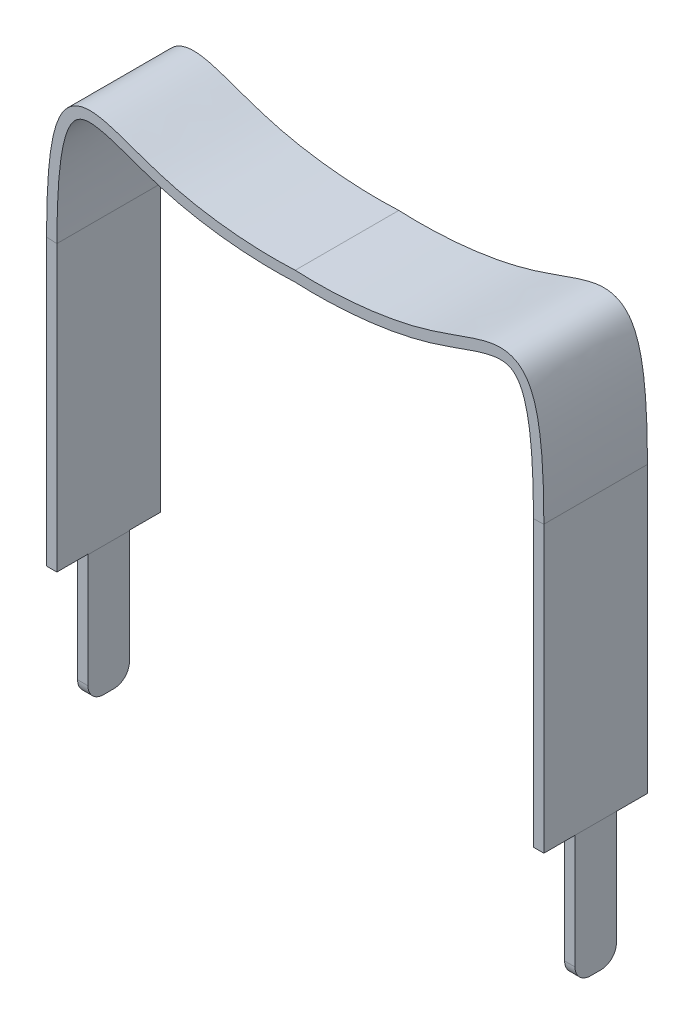
ISO-10303-21;
HEADER;
FILE_DESCRIPTION(('STEP AP214'),'2;1');
FILE_NAME('part.step','',(''),(''),'','','');
FILE_SCHEMA(('AUTOMOTIVE_DESIGN { 1 0 10303 214 1 1 1 1 }'));
ENDSEC;
DATA;
#1=APPLICATION_CONTEXT('core data for automotive mechanical design processes');
#2=APPLICATION_PROTOCOL_DEFINITION('international standard','automotive_design',2000,#1);
#3=PRODUCT_CONTEXT('',#1,'mechanical');
#4=PRODUCT('Part','Part','',(#3));
#5=PRODUCT_RELATED_PRODUCT_CATEGORY('part','',(#4));
#6=PRODUCT_DEFINITION_FORMATION('','',#4);
#7=PRODUCT_DEFINITION_CONTEXT('part definition',#1,'design');
#8=PRODUCT_DEFINITION('design','',#6,#7);
#9=PRODUCT_DEFINITION_SHAPE('','',#8);
#10=(LENGTH_UNIT() NAMED_UNIT(*) SI_UNIT(.MILLI.,.METRE.));
#11=(NAMED_UNIT(*) PLANE_ANGLE_UNIT() SI_UNIT($,.RADIAN.));
#12=(NAMED_UNIT(*) SI_UNIT($,.STERADIAN.) SOLID_ANGLE_UNIT());
#13=UNCERTAINTY_MEASURE_WITH_UNIT(LENGTH_MEASURE(1.E-05),#10,'distance_accuracy_value','');
#14=(GEOMETRIC_REPRESENTATION_CONTEXT(3) GLOBAL_UNCERTAINTY_ASSIGNED_CONTEXT((#13)) GLOBAL_UNIT_ASSIGNED_CONTEXT((#10,
#11,#12)) REPRESENTATION_CONTEXT('',''));
#15=CARTESIAN_POINT('',(0.,0.,0.));
#16=DIRECTION('',(0.,0.,1.));
#17=DIRECTION('',(1.,0.,0.));
#18=AXIS2_PLACEMENT_3D('',#15,#16,#17);
#19=CARTESIAN_POINT('',(4.60011001239072,-0.00468938966361561,-1.));
#20=DIRECTION('',(0.,0.,-1.));
#21=DIRECTION('',(-1.,0.,0.));
#22=AXIS2_PLACEMENT_3D('',#19,#20,#21);
#23=PLANE('',#22);
#24=CARTESIAN_POINT('',(4.79988998760928,0.00468938966361477,-1.));
#25=CARTESIAN_POINT('',(4.79736906915706,1.64256232668729,-1.));
#26=CARTESIAN_POINT('',(4.63816445261843,2.3344664493463,-1.));
#27=CARTESIAN_POINT('',(3.96494341775825,2.58267109440466,-1.));
#28=CARTESIAN_POINT('',(3.71309483453379,2.52221173491782,-1.));
#29=CARTESIAN_POINT('',(3.13476833354588,2.33450839341845,-1.));
#30=CARTESIAN_POINT('',(2.80251719732676,2.1999909974726,-1.));
#31=CARTESIAN_POINT('',(1.73414857685336,1.90774632195062,-1.));
#32=CARTESIAN_POINT('',(0.871144224361081,1.80980564147064,-1.));
#33=CARTESIAN_POINT('',(0.,1.85,-1.));
#34=B_SPLINE_CURVE_WITH_KNOTS('',3,(#24,#25,#26,#27,#28,#29,#30,#31,#32,#33),.UNSPECIFIED.,.F.,
.F.,(4,2,2,2,4),(0.,0.345603902343047,0.518405853514571,0.691207804686095,1.),.UNSPECIFIED.);
#35=CARTESIAN_POINT('',(4.79989310486523,0.00462193471572824,-1.));
#36=VERTEX_POINT('',#35);
#37=CARTESIAN_POINT('',(0.,1.85,-1.));
#38=VERTEX_POINT('',#37);
#39=EDGE_CURVE('E726',#36,#38,#34,.T.);
#40=ORIENTED_EDGE('',*,*,#39,.F.);
#41=DIRECTION('',(0.998962297127053,0.0455448012251821,0.));
#42=VECTOR('',#41,1.);
#43=CARTESIAN_POINT('',(4.6001037702873,-0.00455448012251863,-1.));
#44=LINE('',#43,#42);
#45=CARTESIAN_POINT('',(4.60010689513477,-0.00462193471572911,-1.));
#46=VERTEX_POINT('',#45);
#47=EDGE_CURVE('E222',#46,#36,#44,.T.);
#48=ORIENTED_EDGE('',*,*,#47,.F.);
#49=CARTESIAN_POINT('',(4.60011001239072,-0.00468938966361561,-1.));
#50=CARTESIAN_POINT('',(4.59816009248416,1.67574938847102,-1.));
#51=CARTESIAN_POINT('',(4.41231089421661,2.19786672734431,-1.));
#52=CARTESIAN_POINT('',(3.9846801133214,2.3658120377622,-1.));
#53=CARTESIAN_POINT('',(3.77236359407118,2.3308405005584,-1.));
#54=CARTESIAN_POINT('',(3.21585674486565,2.15131339252838,-1.));
#55=CARTESIAN_POINT('',(2.87743964340638,2.01403083354362,-1.));
#56=CARTESIAN_POINT('',(1.7720906266553,1.70980272424619,-1.));
#57=CARTESIAN_POINT('',(0.892346641341858,1.60979324246757,-1.));
#58=CARTESIAN_POINT('',(0.,1.65,-1.));
#59=B_SPLINE_CURVE_WITH_KNOTS('',3,(#49,#50,#51,#52,#53,#54,#55,#56,#57,#58),.UNSPECIFIED.,.F.,
.F.,(4,2,2,2,4),(0.,0.345603902343047,0.518405853514571,0.691207804686095,1.),.UNSPECIFIED.);
#60=CARTESIAN_POINT('',(0.,1.65,-1.));
#61=VERTEX_POINT('',#60);
#62=EDGE_CURVE('E525',#46,#61,#59,.T.);
#63=ORIENTED_EDGE('',*,*,#62,.T.);
#64=CARTESIAN_POINT('',(-4.60011001239072,-0.00468938966361561,-1.));
#65=CARTESIAN_POINT('',(-4.59816009248416,1.67574938847102,-1.));
#66=CARTESIAN_POINT('',(-4.41231089421661,2.19786672734431,-1.));
#67=CARTESIAN_POINT('',(-3.9846801133214,2.3658120377622,-1.));
#68=CARTESIAN_POINT('',(-3.77236359407118,2.3308405005584,-1.));
#69=CARTESIAN_POINT('',(-3.21585674486565,2.15131339252838,-1.));
#70=CARTESIAN_POINT('',(-2.87743964340638,2.01403083354362,-1.));
#71=CARTESIAN_POINT('',(-1.7720906266553,1.70980272424619,-1.));
#72=CARTESIAN_POINT('',(-0.892346641341858,1.60979324246757,-1.));
#73=CARTESIAN_POINT('',(0.,1.65,-1.));
#74=B_SPLINE_CURVE_WITH_KNOTS('',3,(#64,#65,#66,#67,#68,#69,#70,#71,#72,#73),.UNSPECIFIED.,.F.,
.F.,(4,2,2,2,4),(0.,0.345603902343047,0.518405853514571,0.691207804686095,1.),.UNSPECIFIED.);
#75=CARTESIAN_POINT('',(-4.60010689513477,-0.00462193471572911,-1.));
#76=VERTEX_POINT('',#75);
#77=EDGE_CURVE('E330',#76,#61,#74,.T.);
#78=ORIENTED_EDGE('',*,*,#77,.F.);
#79=DIRECTION('',(-0.998962297127053,0.0455448012251821,0.));
#80=VECTOR('',#79,1.);
#81=CARTESIAN_POINT('',(-4.6001037702873,-0.00455448012251863,-1.));
#82=LINE('',#81,#80);
#83=CARTESIAN_POINT('',(-4.7998934931922,0.00461790692183757,-1.));
#84=VERTEX_POINT('',#83);
#85=EDGE_CURVE('E310',#84,#76,#82,.F.);
#86=ORIENTED_EDGE('',*,*,#85,.F.);
#87=CARTESIAN_POINT('',(-4.79988998760928,0.00468938966361477,-1.));
#88=CARTESIAN_POINT('',(-4.79736906915706,1.64256232668729,-1.));
#89=CARTESIAN_POINT('',(-4.63816445261843,2.3344664493463,-1.));
#90=CARTESIAN_POINT('',(-3.96494341775825,2.58267109440466,-1.));
#91=CARTESIAN_POINT('',(-3.71309483453379,2.52221173491782,-1.));
#92=CARTESIAN_POINT('',(-3.13476833354588,2.33450839341845,-1.));
#93=CARTESIAN_POINT('',(-2.80251719732676,2.1999909974726,-1.));
#94=CARTESIAN_POINT('',(-1.73414857685336,1.90774632195062,-1.));
#95=CARTESIAN_POINT('',(-0.871144224361081,1.80980564147064,-1.));
#96=CARTESIAN_POINT('',(0.,1.85,-1.));
#97=B_SPLINE_CURVE_WITH_KNOTS('',3,(#87,#88,#89,#90,#91,#92,#93,#94,#95,#96),.UNSPECIFIED.,.F.,
.F.,(4,2,2,2,4),(0.,0.345603902343047,0.518405853514571,0.691207804686095,1.),.UNSPECIFIED.);
#98=EDGE_CURVE('E580',#84,#38,#97,.T.);
#99=ORIENTED_EDGE('',*,*,#98,.T.);
#100=EDGE_LOOP('',(#40,#48,#63,#78,#86,#99));
#101=FACE_BOUND('',#100,.T.);
#102=ADVANCED_FACE('F39',(#101),#23,.T.);
#103=CARTESIAN_POINT('',(4.79988998760928,0.00468938966361477,-1.));
#104=CARTESIAN_POINT('',(4.79736906915706,1.64256232668729,-1.));
#105=CARTESIAN_POINT('',(4.63816445261843,2.3344664493463,-1.));
#106=CARTESIAN_POINT('',(3.96494341775825,2.58267109440466,-1.));
#107=CARTESIAN_POINT('',(3.71309483453379,2.52221173491782,-1.));
#108=CARTESIAN_POINT('',(3.13476833354588,2.33450839341845,-1.));
#109=CARTESIAN_POINT('',(2.80251719732676,2.1999909974726,-1.));
#110=CARTESIAN_POINT('',(1.73414857685336,1.90774632195062,-1.));
#111=CARTESIAN_POINT('',(0.871144224361081,1.80980564147064,-1.));
#112=CARTESIAN_POINT('',(0.,1.85,-1.));
#113=CARTESIAN_POINT('',(4.79988998760928,0.00468938966361477,0.999999999999999));
#114=CARTESIAN_POINT('',(4.79736906915706,1.64256232668729,0.999999999999999));
#115=CARTESIAN_POINT('',(4.63816445261843,2.3344664493463,0.999999999999999));
#116=CARTESIAN_POINT('',(3.96494341775825,2.58267109440466,0.999999999999999));
#117=CARTESIAN_POINT('',(3.71309483453379,2.52221173491782,0.999999999999999));
#118=CARTESIAN_POINT('',(3.13476833354588,2.33450839341845,0.999999999999999));
#119=CARTESIAN_POINT('',(2.80251719732676,2.1999909974726,0.999999999999999));
#120=CARTESIAN_POINT('',(1.73414857685336,1.90774632195062,0.999999999999999));
#121=CARTESIAN_POINT('',(0.871144224361081,1.80980564147064,0.999999999999999));
#122=CARTESIAN_POINT('',(0.,1.85,0.999999999999999));
#123=B_SPLINE_SURFACE_WITH_KNOTS('',1,3,((#103,#104,#105,#106,#107,#108,#109,#110,#111,#112),
(#113,#114,#115,#116,#117,#118,#119,#120,#121,#122)),.UNSPECIFIED.,.F.,.F.,.F.,(2,2),(4,2,2,2,
4),(0.,1.),(0.,0.345603902343047,0.518405853514571,0.691207804686095,1.),.UNSPECIFIED.);
#124=CARTESIAN_POINT('',(4.79988998760928,0.00468938966361477,0.999999999999999));
#125=CARTESIAN_POINT('',(4.79736906915706,1.64256232668729,0.999999999999999));
#126=CARTESIAN_POINT('',(4.63816445261843,2.3344664493463,0.999999999999999));
#127=CARTESIAN_POINT('',(3.96494341775825,2.58267109440466,0.999999999999999));
#128=CARTESIAN_POINT('',(3.71309483453379,2.52221173491782,0.999999999999999));
#129=CARTESIAN_POINT('',(3.13476833354588,2.33450839341845,0.999999999999999));
#130=CARTESIAN_POINT('',(2.80251719732676,2.1999909974726,0.999999999999999));
#131=CARTESIAN_POINT('',(1.73414857685336,1.90774632195062,0.999999999999999));
#132=CARTESIAN_POINT('',(0.871144224361081,1.80980564147064,0.999999999999999));
#133=CARTESIAN_POINT('',(0.,1.85,0.999999999999999));
#134=B_SPLINE_CURVE_WITH_KNOTS('',3,(#124,#125,#126,#127,#128,#129,#130,#131,#132,#133),
.UNSPECIFIED.,.F.,.F.,(4,2,2,2,4),(0.,0.345603902343047,0.518405853514571,0.691207804686095,1.),.UNSPECIFIED.);
#135=CARTESIAN_POINT('',(4.7998934931922,0.00461790692183757,0.999999999999999));
#136=VERTEX_POINT('',#135);
#137=CARTESIAN_POINT('',(0.,1.85,0.999999999999999));
#138=VERTEX_POINT('',#137);
#139=EDGE_CURVE('E441',#136,#138,#134,.T.);
#140=DIRECTION('',(0.,0.,1.));
#141=VECTOR('',#140,1.);
#142=CARTESIAN_POINT('',(4.79989622971271,0.00455448012251779,0.999999999999999));
#143=LINE('',#142,#141);
#144=EDGE_CURVE('E227',#36,#136,#143,.T.);
#145=DIRECTION('',(0.,0.,1.));
#146=VECTOR('',#145,1.);
#147=CARTESIAN_POINT('',(0.,1.85,0.999999999999999));
#148=LINE('',#147,#146);
#149=EDGE_CURVE('E249',#38,#138,#148,.T.);
#150=ORIENTED_EDGE('',*,*,#139,.F.);
#151=ORIENTED_EDGE('',*,*,#144,.F.);
#152=ORIENTED_EDGE('',*,*,#39,.T.);
#153=ORIENTED_EDGE('',*,*,#149,.T.);
#154=EDGE_LOOP('',(#150,#151,#152,#153));
#155=FACE_BOUND('',#154,.T.);
#156=ADVANCED_FACE('F383',(#155),#123,.F.);
#157=CARTESIAN_POINT('',(4.60011001239072,-0.00468938966361561,0.999999999999999));
#158=DIRECTION('',(0.,0.,-1.));
#159=DIRECTION('',(-1.,0.,0.));
#160=AXIS2_PLACEMENT_3D('',#157,#158,#159);
#161=PLANE('',#160);
#162=CARTESIAN_POINT('',(4.60011001239072,-0.00468938966361561,0.999999999999999));
#163=CARTESIAN_POINT('',(4.59816009248416,1.67574938847102,0.999999999999999));
#164=CARTESIAN_POINT('',(4.41231089421661,2.19786672734431,0.999999999999999));
#165=CARTESIAN_POINT('',(3.9846801133214,2.3658120377622,0.999999999999999));
#166=CARTESIAN_POINT('',(3.77236359407118,2.3308405005584,0.999999999999999));
#167=CARTESIAN_POINT('',(3.21585674486565,2.15131339252838,0.999999999999999));
#168=CARTESIAN_POINT('',(2.87743964340638,2.01403083354362,0.999999999999999));
#169=CARTESIAN_POINT('',(1.7720906266553,1.70980272424619,0.999999999999999));
#170=CARTESIAN_POINT('',(0.892346641341858,1.60979324246757,0.999999999999999));
#171=CARTESIAN_POINT('',(0.,1.65,0.999999999999999));
#172=B_SPLINE_CURVE_WITH_KNOTS('',3,(#162,#163,#164,#165,#166,#167,#168,#169,#170,#171),
.UNSPECIFIED.,.F.,.F.,(4,2,2,2,4),(0.,0.345603902343047,0.518405853514571,0.691207804686095,1.),.UNSPECIFIED.);
#173=CARTESIAN_POINT('',(4.60010689513477,-0.00462193471572911,0.999999999999999));
#174=VERTEX_POINT('',#173);
#175=CARTESIAN_POINT('',(0.,1.65,0.999999999999999));
#176=VERTEX_POINT('',#175);
#177=EDGE_CURVE('E253',#174,#176,#172,.T.);
#178=ORIENTED_EDGE('',*,*,#177,.F.);
#179=DIRECTION('',(-0.998962297127053,-0.0455448012251821,0.));
#180=VECTOR('',#179,1.);
#181=CARTESIAN_POINT('',(4.6001037702873,-0.00455448012251863,0.999999999999999));
#182=LINE('',#181,#180);
#183=EDGE_CURVE('E435',#136,#174,#182,.T.);
#184=ORIENTED_EDGE('',*,*,#183,.F.);
#185=ORIENTED_EDGE('',*,*,#139,.T.);
#186=CARTESIAN_POINT('',(-4.79988998760928,0.00468938966361477,0.999999999999999));
#187=CARTESIAN_POINT('',(-4.79736906915706,1.64256232668729,0.999999999999999));
#188=CARTESIAN_POINT('',(-4.63816445261843,2.3344664493463,0.999999999999999));
#189=CARTESIAN_POINT('',(-3.96494341775825,2.58267109440466,0.999999999999999));
#190=CARTESIAN_POINT('',(-3.71309483453379,2.52221173491782,0.999999999999999));
#191=CARTESIAN_POINT('',(-3.13476833354588,2.33450839341845,0.999999999999999));
#192=CARTESIAN_POINT('',(-2.80251719732676,2.1999909974726,0.999999999999999));
#193=CARTESIAN_POINT('',(-1.73414857685336,1.90774632195062,0.999999999999999));
#194=CARTESIAN_POINT('',(-0.871144224361081,1.80980564147064,0.999999999999999));
#195=CARTESIAN_POINT('',(0.,1.85,0.999999999999999));
#196=B_SPLINE_CURVE_WITH_KNOTS('',3,(#186,#187,#188,#189,#190,#191,#192,#193,#194,#195),
.UNSPECIFIED.,.F.,.F.,(4,2,2,2,4),(0.,0.345603902343047,0.518405853514571,0.691207804686095,1.),.UNSPECIFIED.);
#197=CARTESIAN_POINT('',(-4.79989310486523,0.00462193471572824,0.999999999999999));
#198=VERTEX_POINT('',#197);
#199=EDGE_CURVE('E587',#198,#138,#196,.T.);
#200=ORIENTED_EDGE('',*,*,#199,.F.);
#201=DIRECTION('',(0.998962297127053,-0.0455448012251821,0.));
#202=VECTOR('',#201,1.);
#203=CARTESIAN_POINT('',(-4.6001037702873,-0.00455448012251863,0.999999999999999));
#204=LINE('',#203,#202);
#205=CARTESIAN_POINT('',(-4.60010689513477,-0.00462193471572911,0.999999999999999));
#206=VERTEX_POINT('',#205);
#207=EDGE_CURVE('E245',#206,#198,#204,.F.);
#208=ORIENTED_EDGE('',*,*,#207,.F.);
#209=CARTESIAN_POINT('',(-4.60011001239072,-0.00468938966361561,0.999999999999999));
#210=CARTESIAN_POINT('',(-4.59816009248416,1.67574938847102,0.999999999999999));
#211=CARTESIAN_POINT('',(-4.41231089421661,2.19786672734431,0.999999999999999));
#212=CARTESIAN_POINT('',(-3.9846801133214,2.3658120377622,0.999999999999999));
#213=CARTESIAN_POINT('',(-3.77236359407118,2.3308405005584,0.999999999999999));
#214=CARTESIAN_POINT('',(-3.21585674486565,2.15131339252838,0.999999999999999));
#215=CARTESIAN_POINT('',(-2.87743964340638,2.01403083354362,0.999999999999999));
#216=CARTESIAN_POINT('',(-1.7720906266553,1.70980272424619,0.999999999999999));
#217=CARTESIAN_POINT('',(-0.892346641341858,1.60979324246757,0.999999999999999));
#218=CARTESIAN_POINT('',(0.,1.65,0.999999999999999));
#219=B_SPLINE_CURVE_WITH_KNOTS('',3,(#209,#210,#211,#212,#213,#214,#215,#216,#217,#218),
.UNSPECIFIED.,.F.,.F.,(4,2,2,2,4),(0.,0.345603902343047,0.518405853514571,0.691207804686095,1.),.UNSPECIFIED.);
#220=EDGE_CURVE('E512',#206,#176,#219,.T.);
#221=ORIENTED_EDGE('',*,*,#220,.T.);
#222=EDGE_LOOP('',(#178,#184,#185,#200,#208,#221));
#223=FACE_BOUND('',#222,.T.);
#224=ADVANCED_FACE('F408',(#223),#161,.F.);
#225=CARTESIAN_POINT('',(4.60011001239072,-0.00468938966361561,0.999999999999999));
#226=CARTESIAN_POINT('',(4.59816009248416,1.67574938847102,0.999999999999999));
#227=CARTESIAN_POINT('',(4.41231089421661,2.19786672734431,0.999999999999999));
#228=CARTESIAN_POINT('',(3.9846801133214,2.3658120377622,0.999999999999999));
#229=CARTESIAN_POINT('',(3.77236359407118,2.3308405005584,0.999999999999999));
#230=CARTESIAN_POINT('',(3.21585674486565,2.15131339252838,0.999999999999999));
#231=CARTESIAN_POINT('',(2.87743964340638,2.01403083354362,0.999999999999999));
#232=CARTESIAN_POINT('',(1.7720906266553,1.70980272424619,0.999999999999999));
#233=CARTESIAN_POINT('',(0.892346641341858,1.60979324246757,0.999999999999999));
#234=CARTESIAN_POINT('',(0.,1.65,0.999999999999999));
#235=CARTESIAN_POINT('',(4.60011001239072,-0.00468938966361561,-1.));
#236=CARTESIAN_POINT('',(4.59816009248416,1.67574938847102,-1.));
#237=CARTESIAN_POINT('',(4.41231089421661,2.19786672734431,-1.));
#238=CARTESIAN_POINT('',(3.9846801133214,2.3658120377622,-1.));
#239=CARTESIAN_POINT('',(3.77236359407118,2.3308405005584,-1.));
#240=CARTESIAN_POINT('',(3.21585674486565,2.15131339252838,-1.));
#241=CARTESIAN_POINT('',(2.87743964340638,2.01403083354362,-1.));
#242=CARTESIAN_POINT('',(1.7720906266553,1.70980272424619,-1.));
#243=CARTESIAN_POINT('',(0.892346641341858,1.60979324246757,-1.));
#244=CARTESIAN_POINT('',(0.,1.65,-1.));
#245=B_SPLINE_SURFACE_WITH_KNOTS('',1,3,((#225,#226,#227,#228,#229,#230,#231,#232,#233,#234),
(#235,#236,#237,#238,#239,#240,#241,#242,#243,#244)),.UNSPECIFIED.,.F.,.F.,.F.,(2,2),(4,2,2,2,
4),(0.,1.),(0.,0.345603902343047,0.518405853514571,0.691207804686095,1.),.UNSPECIFIED.);
#246=DIRECTION('',(0.,0.,-1.));
#247=VECTOR('',#246,1.);
#248=CARTESIAN_POINT('',(0.,1.65,0.999999999999999));
#249=LINE('',#248,#247);
#250=EDGE_CURVE('E243',#176,#61,#249,.T.);
#251=DIRECTION('',(0.,0.,-1.));
#252=VECTOR('',#251,1.);
#253=CARTESIAN_POINT('',(4.6001037702873,-0.00455448012251863,0.999999999999999));
#254=LINE('',#253,#252);
#255=EDGE_CURVE('E262',#174,#46,#254,.T.);
#256=ORIENTED_EDGE('',*,*,#250,.T.);
#257=ORIENTED_EDGE('',*,*,#62,.F.);
#258=ORIENTED_EDGE('',*,*,#255,.F.);
#259=ORIENTED_EDGE('',*,*,#177,.T.);
#260=EDGE_LOOP('',(#256,#257,#258,#259));
#261=FACE_BOUND('',#260,.T.);
#262=ADVANCED_FACE('F41',(#261),#245,.F.);
#263=CARTESIAN_POINT('',(4.79989622971271,-7.99544551987748,0.999999999999999));
#264=DIRECTION('',(-1.,0.,0.));
#265=DIRECTION('',(0.,0.,1.));
#266=AXIS2_PLACEMENT_3D('',#263,#264,#265);
#267=PLANE('',#266);
#268=DIRECTION('',(0.,0.,1.));
#269=VECTOR('',#268,1.);
#270=CARTESIAN_POINT('',(4.79989622971271,-5.49544551987748,0.999999999999999));
#271=LINE('',#270,#269);
#272=CARTESIAN_POINT('',(4.79989622971271,-5.49544551987748,-0.400000000000002));
#273=VERTEX_POINT('',#272);
#274=CARTESIAN_POINT('',(4.79989622971271,-5.49544551987748,0.399999999999999));
#275=VERTEX_POINT('',#274);
#276=EDGE_CURVE('E234',#273,#275,#271,.T.);
#277=ORIENTED_EDGE('',*,*,#276,.T.);
#278=DIRECTION('',(0.,1.,0.));
#279=VECTOR('',#278,1.);
#280=CARTESIAN_POINT('',(4.79989622971271,-5.49544551987748,0.399999999999999));
#281=LINE('',#280,#279);
#282=CARTESIAN_POINT('',(4.79989622971271,-7.69544551987748,0.399999999999999));
#283=VERTEX_POINT('',#282);
#284=EDGE_CURVE('E695',#283,#275,#281,.T.);
#285=ORIENTED_EDGE('',*,*,#284,.F.);
#286=CARTESIAN_POINT('',(4.79989622971271,-7.69544551987748,0.0999999999999985));
#287=DIRECTION('',(-1.,0.,0.));
#288=DIRECTION('',(0.,0.,1.));
#289=AXIS2_PLACEMENT_3D('',#286,#287,#288);
#290=CIRCLE('',#289,0.3);
#291=CARTESIAN_POINT('',(4.79989622971271,-7.99544551987748,0.0999999999999963));
#292=VERTEX_POINT('',#291);
#293=EDGE_CURVE('E698',#292,#283,#290,.T.);
#294=ORIENTED_EDGE('',*,*,#293,.F.);
#295=DIRECTION('',(0.,0.,1.));
#296=VECTOR('',#295,1.);
#297=CARTESIAN_POINT('',(4.79989622971271,-7.99544551987748,0.0999999999999964));
#298=LINE('',#297,#296);
#299=CARTESIAN_POINT('',(4.79989622971271,-7.99544551987748,-0.0999999999999996));
#300=VERTEX_POINT('',#299);
#301=EDGE_CURVE('E702',#300,#292,#298,.T.);
#302=ORIENTED_EDGE('',*,*,#301,.F.);
#303=CARTESIAN_POINT('',(4.79989622971271,-7.69544551987748,-0.100000000000002));
#304=DIRECTION('',(-1.,0.,0.));
#305=DIRECTION('',(0.,0.,1.));
#306=AXIS2_PLACEMENT_3D('',#303,#304,#305);
#307=CIRCLE('',#306,0.3);
#308=CARTESIAN_POINT('',(4.79989622971271,-7.69544551987748,-0.400000000000002));
#309=VERTEX_POINT('',#308);
#310=EDGE_CURVE('E706',#309,#300,#307,.T.);
#311=ORIENTED_EDGE('',*,*,#310,.F.);
#312=DIRECTION('',(0.,-1.,0.));
#313=VECTOR('',#312,1.);
#314=CARTESIAN_POINT('',(4.79989622971271,-7.69544551987748,-0.400000000000002));
#315=LINE('',#314,#313);
#316=EDGE_CURVE('E710',#273,#309,#315,.T.);
#317=ORIENTED_EDGE('',*,*,#316,.F.);
#318=EDGE_LOOP('',(#277,#285,#294,#302,#311,#317));
#319=FACE_BOUND('',#318,.T.);
#320=ADVANCED_FACE('F359',(#319),#267,.F.);
#321=CARTESIAN_POINT('',(4.6001037702873,-8.00455448012252,0.999999999999999));
#322=DIRECTION('',(1.,0.,0.));
#323=DIRECTION('',(0.,0.,-1.));
#324=AXIS2_PLACEMENT_3D('',#321,#322,#323);
#325=PLANE('',#324);
#326=CARTESIAN_POINT('',(4.6001037702873,-7.69544551987748,0.0999999999999985));
#327=DIRECTION('',(1.,0.,0.));
#328=DIRECTION('',(0.,0.,-1.));
#329=AXIS2_PLACEMENT_3D('',#326,#327,#328);
#330=CIRCLE('',#329,0.3);
#331=CARTESIAN_POINT('',(4.6001037702873,-7.99544551987748,0.0999999999999963));
#332=VERTEX_POINT('',#331);
#333=CARTESIAN_POINT('',(4.6001037702873,-7.69544551987748,0.399999999999999));
#334=VERTEX_POINT('',#333);
#335=EDGE_CURVE('E509',#332,#334,#330,.F.);
#336=ORIENTED_EDGE('',*,*,#335,.T.);
#337=DIRECTION('',(0.,1.,0.));
#338=VECTOR('',#337,1.);
#339=CARTESIAN_POINT('',(4.6001037702873,-8.00455448012252,0.399999999999998));
#340=LINE('',#339,#338);
#341=CARTESIAN_POINT('',(4.6001037702873,-5.50455448012252,0.399999999999999));
#342=VERTEX_POINT('',#341);
#343=EDGE_CURVE('E476',#334,#342,#340,.T.);
#344=ORIENTED_EDGE('',*,*,#343,.T.);
#345=DIRECTION('',(0.,0.,-1.));
#346=VECTOR('',#345,1.);
#347=CARTESIAN_POINT('',(4.6001037702873,-5.50455448012252,0.999999999999999));
#348=LINE('',#347,#346);
#349=CARTESIAN_POINT('',(4.6001037702873,-5.50455448012252,-0.400000000000002));
#350=VERTEX_POINT('',#349);
#351=EDGE_CURVE('E236',#342,#350,#348,.T.);
#352=ORIENTED_EDGE('',*,*,#351,.T.);
#353=DIRECTION('',(0.,-1.,0.));
#354=VECTOR('',#353,1.);
#355=CARTESIAN_POINT('',(4.6001037702873,-8.00455448012252,-0.400000000000002));
#356=LINE('',#355,#354);
#357=CARTESIAN_POINT('',(4.6001037702873,-7.69544551987748,-0.400000000000002));
#358=VERTEX_POINT('',#357);
#359=EDGE_CURVE('E647',#350,#358,#356,.T.);
#360=ORIENTED_EDGE('',*,*,#359,.T.);
#361=CARTESIAN_POINT('',(4.6001037702873,-7.69544551987748,-0.100000000000002));
#362=DIRECTION('',(1.,0.,0.));
#363=DIRECTION('',(0.,0.,-1.));
#364=AXIS2_PLACEMENT_3D('',#361,#362,#363);
#365=CIRCLE('',#364,0.3);
#366=CARTESIAN_POINT('',(4.6001037702873,-7.99544551987748,-0.0999999999999996));
#367=VERTEX_POINT('',#366);
#368=EDGE_CURVE('E493',#358,#367,#365,.F.);
#369=ORIENTED_EDGE('',*,*,#368,.T.);
#370=DIRECTION('',(0.,0.,1.));
#371=VECTOR('',#370,1.);
#372=CARTESIAN_POINT('',(4.6001037702873,-7.99544551987748,0.999999999999999));
#373=LINE('',#372,#371);
#374=EDGE_CURVE('E501',#367,#332,#373,.T.);
#375=ORIENTED_EDGE('',*,*,#374,.T.);
#376=EDGE_LOOP('',(#336,#344,#352,#360,#369,#375));
#377=FACE_BOUND('',#376,.T.);
#378=ADVANCED_FACE('F358',(#377),#325,.F.);
#379=CARTESIAN_POINT('',(4.6001037702873,-5.50455448012252,-1.));
#380=DIRECTION('',(0.,0.,1.));
#381=DIRECTION('',(1.,0.,0.));
#382=AXIS2_PLACEMENT_3D('',#379,#380,#381);
#383=PLANE('',#382);
#384=DIRECTION('',(0.,1.,0.));
#385=VECTOR('',#384,1.);
#386=CARTESIAN_POINT('',(4.79989622971271,-5.49544551987748,-1.));
#387=LINE('',#386,#385);
#388=CARTESIAN_POINT('',(4.79989622971271,-5.49544551987748,-1.));
#389=VERTEX_POINT('',#388);
#390=EDGE_CURVE('E219',#389,#36,#387,.T.);
#391=ORIENTED_EDGE('',*,*,#390,.F.);
#392=DIRECTION('',(1.,0.,0.));
#393=VECTOR('',#392,1.);
#394=CARTESIAN_POINT('',(-4.80122470333182,-5.49544551987748,-1.));
#395=LINE('',#394,#393);
#396=CARTESIAN_POINT('',(4.6001037702873,-5.49544551987748,-1.));
#397=VERTEX_POINT('',#396);
#398=EDGE_CURVE('E205',#397,#389,#395,.T.);
#399=ORIENTED_EDGE('',*,*,#398,.F.);
#400=DIRECTION('',(0.,1.,0.));
#401=VECTOR('',#400,1.);
#402=CARTESIAN_POINT('',(4.6001037702873,-5.50455448012252,-1.));
#403=LINE('',#402,#401);
#404=EDGE_CURVE('E241',#397,#46,#403,.T.);
#405=ORIENTED_EDGE('',*,*,#404,.T.);
#406=ORIENTED_EDGE('',*,*,#47,.T.);
#407=EDGE_LOOP('',(#391,#399,#405,#406));
#408=FACE_BOUND('',#407,.T.);
#409=ADVANCED_FACE('F220',(#408),#383,.F.);
#410=CARTESIAN_POINT('',(4.79989622971271,-5.49544551987748,0.999999999999999));
#411=DIRECTION('',(-1.,0.,0.));
#412=DIRECTION('',(0.,0.,1.));
#413=AXIS2_PLACEMENT_3D('',#410,#411,#412);
#414=PLANE('',#413);
#415=DIRECTION('',(0.,1.,0.));
#416=VECTOR('',#415,1.);
#417=CARTESIAN_POINT('',(4.79989622971271,-5.49544551987748,0.999999999999999));
#418=LINE('',#417,#416);
#419=CARTESIAN_POINT('',(4.79989622971271,-5.49544551987748,0.999999999999999));
#420=VERTEX_POINT('',#419);
#421=EDGE_CURVE('E735',#420,#136,#418,.T.);
#422=ORIENTED_EDGE('',*,*,#421,.F.);
#423=DIRECTION('',(0.,0.,1.));
#424=VECTOR('',#423,1.);
#425=CARTESIAN_POINT('',(4.79989622971271,-5.49544551987748,0.999999999999999));
#426=LINE('',#425,#424);
#427=EDGE_CURVE('E216',#275,#420,#426,.T.);
#428=ORIENTED_EDGE('',*,*,#427,.F.);
#429=ORIENTED_EDGE('',*,*,#276,.F.);
#430=EDGE_CURVE('E209',#389,#273,#271,.T.);
#431=ORIENTED_EDGE('',*,*,#430,.F.);
#432=ORIENTED_EDGE('',*,*,#390,.T.);
#433=ORIENTED_EDGE('',*,*,#144,.T.);
#434=EDGE_LOOP('',(#422,#428,#429,#431,#432,#433));
#435=FACE_BOUND('',#434,.T.);
#436=ADVANCED_FACE('F231',(#435),#414,.F.);
#437=CARTESIAN_POINT('',(4.6001037702873,-5.50455448012252,0.999999999999999));
#438=DIRECTION('',(0.,0.,-1.));
#439=DIRECTION('',(-1.,0.,0.));
#440=AXIS2_PLACEMENT_3D('',#437,#438,#439);
#441=PLANE('',#440);
#442=DIRECTION('',(0.,1.,0.));
#443=VECTOR('',#442,1.);
#444=CARTESIAN_POINT('',(4.6001037702873,-5.50455448012252,0.999999999999999));
#445=LINE('',#444,#443);
#446=CARTESIAN_POINT('',(4.6001037702873,-5.49544551987748,0.999999999999999));
#447=VERTEX_POINT('',#446);
#448=EDGE_CURVE('E46',#447,#174,#445,.T.);
#449=ORIENTED_EDGE('',*,*,#448,.F.);
#450=DIRECTION('',(1.,0.,0.));
#451=VECTOR('',#450,1.);
#452=CARTESIAN_POINT('',(-4.80122470333182,-5.49544551987748,0.999999999999999));
#453=LINE('',#452,#451);
#454=EDGE_CURVE('E635',#447,#420,#453,.T.);
#455=ORIENTED_EDGE('',*,*,#454,.T.);
#456=ORIENTED_EDGE('',*,*,#421,.T.);
#457=ORIENTED_EDGE('',*,*,#183,.T.);
#458=EDGE_LOOP('',(#449,#455,#456,#457));
#459=FACE_BOUND('',#458,.T.);
#460=ADVANCED_FACE('F443',(#459),#441,.F.);
#461=CARTESIAN_POINT('',(4.6001037702873,-5.50455448012252,0.999999999999999));
#462=DIRECTION('',(1.,0.,0.));
#463=DIRECTION('',(0.,0.,-1.));
#464=AXIS2_PLACEMENT_3D('',#461,#462,#463);
#465=PLANE('',#464);
#466=DIRECTION('',(0.,1.,0.));
#467=VECTOR('',#466,1.);
#468=CARTESIAN_POINT('',(4.6001037702873,-5.50455448012252,0.399999999999999));
#469=LINE('',#468,#467);
#470=CARTESIAN_POINT('',(4.6001037702873,-5.49544551987748,0.399999999999999));
#471=VERTEX_POINT('',#470);
#472=EDGE_CURVE('E469',#342,#471,#469,.T.);
#473=ORIENTED_EDGE('',*,*,#472,.T.);
#474=DIRECTION('',(0.,0.,1.));
#475=VECTOR('',#474,1.);
#476=CARTESIAN_POINT('',(4.6001037702873,-5.49544551987748,0.999999999999999));
#477=LINE('',#476,#475);
#478=EDGE_CURVE('E470',#471,#447,#477,.T.);
#479=ORIENTED_EDGE('',*,*,#478,.T.);
#480=ORIENTED_EDGE('',*,*,#448,.T.);
#481=ORIENTED_EDGE('',*,*,#255,.T.);
#482=ORIENTED_EDGE('',*,*,#404,.F.);
#483=DIRECTION('',(0.,0.,1.));
#484=VECTOR('',#483,1.);
#485=CARTESIAN_POINT('',(4.6001037702873,-5.49544551987748,0.999999999999999));
#486=LINE('',#485,#484);
#487=CARTESIAN_POINT('',(4.6001037702873,-5.49544551987748,-0.400000000000002));
#488=VERTEX_POINT('',#487);
#489=EDGE_CURVE('E212',#397,#488,#486,.T.);
#490=ORIENTED_EDGE('',*,*,#489,.T.);
#491=DIRECTION('',(0.,-1.,0.));
#492=VECTOR('',#491,1.);
#493=CARTESIAN_POINT('',(4.6001037702873,-5.50455448012252,-0.400000000000002));
#494=LINE('',#493,#492);
#495=EDGE_CURVE('E644',#488,#350,#494,.T.);
#496=ORIENTED_EDGE('',*,*,#495,.T.);
#497=ORIENTED_EDGE('',*,*,#351,.F.);
#498=EDGE_LOOP('',(#473,#479,#480,#481,#482,#490,#496,#497));
#499=FACE_BOUND('',#498,.T.);
#500=ADVANCED_FACE('F386',(#499),#465,.F.);
#501=CARTESIAN_POINT('',(-4.79988998760928,0.00468938966361477,0.999999999999999));
#502=CARTESIAN_POINT('',(-4.79736906915706,1.64256232668729,0.999999999999999));
#503=CARTESIAN_POINT('',(-4.63816445261843,2.3344664493463,0.999999999999999));
#504=CARTESIAN_POINT('',(-3.96494341775825,2.58267109440466,0.999999999999999));
#505=CARTESIAN_POINT('',(-3.71309483453379,2.52221173491782,0.999999999999999));
#506=CARTESIAN_POINT('',(-3.13476833354588,2.33450839341845,0.999999999999999));
#507=CARTESIAN_POINT('',(-2.80251719732676,2.1999909974726,0.999999999999999));
#508=CARTESIAN_POINT('',(-1.73414857685336,1.90774632195062,0.999999999999999));
#509=CARTESIAN_POINT('',(-0.871144224361081,1.80980564147064,0.999999999999999));
#510=CARTESIAN_POINT('',(0.,1.85,0.999999999999999));
#511=CARTESIAN_POINT('',(-4.79988998760928,0.00468938966361477,-1.));
#512=CARTESIAN_POINT('',(-4.79736906915706,1.64256232668729,-1.));
#513=CARTESIAN_POINT('',(-4.63816445261843,2.3344664493463,-1.));
#514=CARTESIAN_POINT('',(-3.96494341775825,2.58267109440466,-1.));
#515=CARTESIAN_POINT('',(-3.71309483453379,2.52221173491782,-1.));
#516=CARTESIAN_POINT('',(-3.13476833354588,2.33450839341845,-1.));
#517=CARTESIAN_POINT('',(-2.80251719732676,2.1999909974726,-1.));
#518=CARTESIAN_POINT('',(-1.73414857685336,1.90774632195062,-1.));
#519=CARTESIAN_POINT('',(-0.871144224361081,1.80980564147064,-1.));
#520=CARTESIAN_POINT('',(0.,1.85,-1.));
#521=B_SPLINE_SURFACE_WITH_KNOTS('',1,3,((#501,#502,#503,#504,#505,#506,#507,#508,#509,#510),
(#511,#512,#513,#514,#515,#516,#517,#518,#519,#520)),.UNSPECIFIED.,.F.,.F.,.F.,(2,2),(4,2,2,2,
4),(0.,1.),(0.,0.345603902343047,0.518405853514571,0.691207804686095,1.),.UNSPECIFIED.);
#522=DIRECTION('',(0.,0.,1.));
#523=VECTOR('',#522,1.);
#524=CARTESIAN_POINT('',(-4.79989622971271,0.00455448012251779,0.999999999999999));
#525=LINE('',#524,#523);
#526=EDGE_CURVE('E526',#198,#84,#525,.F.);
#527=ORIENTED_EDGE('',*,*,#98,.F.);
#528=ORIENTED_EDGE('',*,*,#526,.F.);
#529=ORIENTED_EDGE('',*,*,#199,.T.);
#530=ORIENTED_EDGE('',*,*,#149,.F.);
#531=EDGE_LOOP('',(#527,#528,#529,#530));
#532=FACE_BOUND('',#531,.T.);
#533=ADVANCED_FACE('F345',(#532),#521,.F.);
#534=CARTESIAN_POINT('',(-4.60011001239072,-0.00468938966361561,-1.));
#535=CARTESIAN_POINT('',(-4.59816009248416,1.67574938847102,-1.));
#536=CARTESIAN_POINT('',(-4.41231089421661,2.19786672734431,-1.));
#537=CARTESIAN_POINT('',(-3.9846801133214,2.3658120377622,-1.));
#538=CARTESIAN_POINT('',(-3.77236359407118,2.3308405005584,-1.));
#539=CARTESIAN_POINT('',(-3.21585674486565,2.15131339252838,-1.));
#540=CARTESIAN_POINT('',(-2.87743964340638,2.01403083354362,-1.));
#541=CARTESIAN_POINT('',(-1.7720906266553,1.70980272424619,-1.));
#542=CARTESIAN_POINT('',(-0.892346641341858,1.60979324246757,-1.));
#543=CARTESIAN_POINT('',(0.,1.65,-1.));
#544=CARTESIAN_POINT('',(-4.60011001239072,-0.00468938966361561,0.999999999999999));
#545=CARTESIAN_POINT('',(-4.59816009248416,1.67574938847102,0.999999999999999));
#546=CARTESIAN_POINT('',(-4.41231089421661,2.19786672734431,0.999999999999999));
#547=CARTESIAN_POINT('',(-3.9846801133214,2.3658120377622,0.999999999999999));
#548=CARTESIAN_POINT('',(-3.77236359407118,2.3308405005584,0.999999999999999));
#549=CARTESIAN_POINT('',(-3.21585674486565,2.15131339252838,0.999999999999999));
#550=CARTESIAN_POINT('',(-2.87743964340638,2.01403083354362,0.999999999999999));
#551=CARTESIAN_POINT('',(-1.7720906266553,1.70980272424619,0.999999999999999));
#552=CARTESIAN_POINT('',(-0.892346641341858,1.60979324246757,0.999999999999999));
#553=CARTESIAN_POINT('',(0.,1.65,0.999999999999999));
#554=B_SPLINE_SURFACE_WITH_KNOTS('',1,3,((#534,#535,#536,#537,#538,#539,#540,#541,#542,#543),
(#544,#545,#546,#547,#548,#549,#550,#551,#552,#553)),.UNSPECIFIED.,.F.,.F.,.F.,(2,2),(4,2,2,2,
4),(0.,1.),(0.,0.345603902343047,0.518405853514571,0.691207804686095,1.),.UNSPECIFIED.);
#555=DIRECTION('',(0.,0.,-1.));
#556=VECTOR('',#555,1.);
#557=CARTESIAN_POINT('',(-4.6001037702873,-0.00455448012251863,0.999999999999999));
#558=LINE('',#557,#556);
#559=EDGE_CURVE('E309',#76,#206,#558,.F.);
#560=ORIENTED_EDGE('',*,*,#250,.F.);
#561=ORIENTED_EDGE('',*,*,#220,.F.);
#562=ORIENTED_EDGE('',*,*,#559,.F.);
#563=ORIENTED_EDGE('',*,*,#77,.T.);
#564=EDGE_LOOP('',(#560,#561,#562,#563));
#565=FACE_BOUND('',#564,.T.);
#566=ADVANCED_FACE('F332',(#565),#554,.F.);
#567=CARTESIAN_POINT('',(-4.79989622971271,-7.99544551987748,0.999999999999999));
#568=DIRECTION('',(1.,0.,0.));
#569=DIRECTION('',(0.,0.,-1.));
#570=AXIS2_PLACEMENT_3D('',#567,#568,#569);
#571=PLANE('',#570);
#572=CARTESIAN_POINT('',(-4.79989622971271,-7.69544551987748,0.0999999999999985));
#573=DIRECTION('',(1.,0.,0.));
#574=DIRECTION('',(0.,0.,-1.));
#575=AXIS2_PLACEMENT_3D('',#572,#573,#574);
#576=CIRCLE('',#575,0.3);
#577=CARTESIAN_POINT('',(-4.79989622971271,-7.99544551987748,0.0999999999999963));
#578=VERTEX_POINT('',#577);
#579=CARTESIAN_POINT('',(-4.79989622971271,-7.69544551987748,0.399999999999999));
#580=VERTEX_POINT('',#579);
#581=EDGE_CURVE('E505',#578,#580,#576,.F.);
#582=ORIENTED_EDGE('',*,*,#581,.T.);
#583=DIRECTION('',(0.,1.,0.));
#584=VECTOR('',#583,1.);
#585=CARTESIAN_POINT('',(-4.79989622971271,-7.99544551987748,0.399999999999998));
#586=LINE('',#585,#584);
#587=CARTESIAN_POINT('',(-4.79989622971271,-5.49544551987748,0.399999999999999));
#588=VERTEX_POINT('',#587);
#589=EDGE_CURVE('E477',#580,#588,#586,.T.);
#590=ORIENTED_EDGE('',*,*,#589,.T.);
#591=DIRECTION('',(0.,0.,1.));
#592=VECTOR('',#591,1.);
#593=CARTESIAN_POINT('',(-4.79989622971271,-5.49544551987748,0.999999999999999));
#594=LINE('',#593,#592);
#595=CARTESIAN_POINT('',(-4.79989622971271,-5.49544551987748,-0.400000000000002));
#596=VERTEX_POINT('',#595);
#597=EDGE_CURVE('E517',#588,#596,#594,.F.);
#598=ORIENTED_EDGE('',*,*,#597,.T.);
#599=DIRECTION('',(0.,-1.,0.));
#600=VECTOR('',#599,1.);
#601=CARTESIAN_POINT('',(-4.79989622971271,-7.99544551987748,-0.400000000000002));
#602=LINE('',#601,#600);
#603=CARTESIAN_POINT('',(-4.79989622971271,-7.69544551987748,-0.400000000000002));
#604=VERTEX_POINT('',#603);
#605=EDGE_CURVE('E624',#596,#604,#602,.T.);
#606=ORIENTED_EDGE('',*,*,#605,.T.);
#607=CARTESIAN_POINT('',(-4.79989622971271,-7.69544551987748,-0.100000000000002));
#608=DIRECTION('',(1.,0.,0.));
#609=DIRECTION('',(0.,0.,-1.));
#610=AXIS2_PLACEMENT_3D('',#607,#608,#609);
#611=CIRCLE('',#610,0.3);
#612=CARTESIAN_POINT('',(-4.79989622971271,-7.99544551987748,-0.0999999999999996));
#613=VERTEX_POINT('',#612);
#614=EDGE_CURVE('E489',#604,#613,#611,.F.);
#615=ORIENTED_EDGE('',*,*,#614,.T.);
#616=DIRECTION('',(0.,0.,1.));
#617=VECTOR('',#616,1.);
#618=CARTESIAN_POINT('',(-4.79989622971271,-7.99544551987748,0.999999999999999));
#619=LINE('',#618,#617);
#620=EDGE_CURVE('E497',#613,#578,#619,.T.);
#621=ORIENTED_EDGE('',*,*,#620,.T.);
#622=EDGE_LOOP('',(#582,#590,#598,#606,#615,#621));
#623=FACE_BOUND('',#622,.T.);
#624=ADVANCED_FACE('F344',(#623),#571,.F.);
#625=CARTESIAN_POINT('',(-4.6001037702873,-8.00455448012252,0.999999999999999));
#626=DIRECTION('',(-1.,0.,0.));
#627=DIRECTION('',(0.,0.,1.));
#628=AXIS2_PLACEMENT_3D('',#625,#626,#627);
#629=PLANE('',#628);
#630=DIRECTION('',(0.,0.,-1.));
#631=VECTOR('',#630,1.);
#632=CARTESIAN_POINT('',(-4.6001037702873,-5.50455448012252,0.999999999999999));
#633=LINE('',#632,#631);
#634=CARTESIAN_POINT('',(-4.6001037702873,-5.50455448012252,-0.400000000000002));
#635=VERTEX_POINT('',#634);
#636=CARTESIAN_POINT('',(-4.6001037702873,-5.50455448012252,0.399999999999999));
#637=VERTEX_POINT('',#636);
#638=EDGE_CURVE('E516',#635,#637,#633,.F.);
#639=ORIENTED_EDGE('',*,*,#638,.T.);
#640=DIRECTION('',(0.,-1.,0.));
#641=VECTOR('',#640,1.);
#642=CARTESIAN_POINT('',(-4.6001037702873,-8.00455448012252,0.399999999999998));
#643=LINE('',#642,#641);
#644=CARTESIAN_POINT('',(-4.6001037702873,-7.69544551987748,0.399999999999999));
#645=VERTEX_POINT('',#644);
#646=EDGE_CURVE('E483',#637,#645,#643,.T.);
#647=ORIENTED_EDGE('',*,*,#646,.T.);
#648=CARTESIAN_POINT('',(-4.6001037702873,-7.69544551987748,0.0999999999999985));
#649=DIRECTION('',(-1.,0.,0.));
#650=DIRECTION('',(0.,0.,1.));
#651=AXIS2_PLACEMENT_3D('',#648,#649,#650);
#652=CIRCLE('',#651,0.3);
#653=CARTESIAN_POINT('',(-4.6001037702873,-7.99544551987748,0.0999999999999963));
#654=VERTEX_POINT('',#653);
#655=EDGE_CURVE('E11',#645,#654,#652,.F.);
#656=ORIENTED_EDGE('',*,*,#655,.T.);
#657=DIRECTION('',(0.,0.,-1.));
#658=VECTOR('',#657,1.);
#659=CARTESIAN_POINT('',(-4.6001037702873,-7.99544551987748,0.999999999999999));
#660=LINE('',#659,#658);
#661=CARTESIAN_POINT('',(-4.6001037702873,-7.99544551987748,-0.0999999999999996));
#662=VERTEX_POINT('',#661);
#663=EDGE_CURVE('E53',#654,#662,#660,.T.);
#664=ORIENTED_EDGE('',*,*,#663,.T.);
#665=CARTESIAN_POINT('',(-4.6001037702873,-7.69544551987748,-0.100000000000002));
#666=DIRECTION('',(-1.,0.,0.));
#667=DIRECTION('',(0.,0.,1.));
#668=AXIS2_PLACEMENT_3D('',#665,#666,#667);
#669=CIRCLE('',#668,0.3);
#670=CARTESIAN_POINT('',(-4.6001037702873,-7.69544551987748,-0.400000000000002));
#671=VERTEX_POINT('',#670);
#672=EDGE_CURVE('E287',#662,#671,#669,.F.);
#673=ORIENTED_EDGE('',*,*,#672,.T.);
#674=DIRECTION('',(0.,1.,0.));
#675=VECTOR('',#674,1.);
#676=CARTESIAN_POINT('',(-4.6001037702873,-8.00455448012252,-0.400000000000002));
#677=LINE('',#676,#675);
#678=EDGE_CURVE('E633',#671,#635,#677,.T.);
#679=ORIENTED_EDGE('',*,*,#678,.T.);
#680=EDGE_LOOP('',(#639,#647,#656,#664,#673,#679));
#681=FACE_BOUND('',#680,.T.);
#682=ADVANCED_FACE('F574',(#681),#629,.F.);
#683=CARTESIAN_POINT('',(-4.6001037702873,-5.50455448012252,0.999999999999999));
#684=DIRECTION('',(0.,0.,-1.));
#685=DIRECTION('',(-1.,0.,0.));
#686=AXIS2_PLACEMENT_3D('',#683,#684,#685);
#687=PLANE('',#686);
#688=DIRECTION('',(0.,1.,0.));
#689=VECTOR('',#688,1.);
#690=CARTESIAN_POINT('',(-4.79989622971271,-5.49544551987748,0.999999999999999));
#691=LINE('',#690,#689);
#692=CARTESIAN_POINT('',(-4.79989622971271,-5.49544551987748,0.999999999999999));
#693=VERTEX_POINT('',#692);
#694=EDGE_CURVE('E531',#693,#198,#691,.T.);
#695=ORIENTED_EDGE('',*,*,#694,.F.);
#696=CARTESIAN_POINT('',(-4.6001037702873,-5.49544551987748,0.999999999999999));
#697=VERTEX_POINT('',#696);
#698=EDGE_CURVE('E629',#693,#697,#453,.T.);
#699=ORIENTED_EDGE('',*,*,#698,.T.);
#700=DIRECTION('',(0.,1.,0.));
#701=VECTOR('',#700,1.);
#702=CARTESIAN_POINT('',(-4.6001037702873,-5.50455448012252,0.999999999999999));
#703=LINE('',#702,#701);
#704=EDGE_CURVE('E311',#697,#206,#703,.T.);
#705=ORIENTED_EDGE('',*,*,#704,.T.);
#706=ORIENTED_EDGE('',*,*,#207,.T.);
#707=EDGE_LOOP('',(#695,#699,#705,#706));
#708=FACE_BOUND('',#707,.T.);
#709=ADVANCED_FACE('F569',(#708),#687,.F.);
#710=CARTESIAN_POINT('',(-4.79989622971271,-5.49544551987748,0.999999999999999));
#711=DIRECTION('',(1.,0.,0.));
#712=DIRECTION('',(0.,0.,-1.));
#713=AXIS2_PLACEMENT_3D('',#710,#711,#712);
#714=PLANE('',#713);
#715=DIRECTION('',(0.,1.,0.));
#716=VECTOR('',#715,1.);
#717=CARTESIAN_POINT('',(-4.79989622971271,-5.49544551987748,-1.));
#718=LINE('',#717,#716);
#719=CARTESIAN_POINT('',(-4.79989622971271,-5.49544551987748,-1.));
#720=VERTEX_POINT('',#719);
#721=EDGE_CURVE('E530',#720,#84,#718,.T.);
#722=ORIENTED_EDGE('',*,*,#721,.F.);
#723=DIRECTION('',(0.,0.,1.));
#724=VECTOR('',#723,1.);
#725=CARTESIAN_POINT('',(-4.79989622971271,-5.49544551987748,0.999999999999999));
#726=LINE('',#725,#724);
#727=EDGE_CURVE('E626',#720,#596,#726,.T.);
#728=ORIENTED_EDGE('',*,*,#727,.T.);
#729=ORIENTED_EDGE('',*,*,#597,.F.);
#730=EDGE_CURVE('E513',#693,#588,#594,.F.);
#731=ORIENTED_EDGE('',*,*,#730,.F.);
#732=ORIENTED_EDGE('',*,*,#694,.T.);
#733=ORIENTED_EDGE('',*,*,#526,.T.);
#734=EDGE_LOOP('',(#722,#728,#729,#731,#732,#733));
#735=FACE_BOUND('',#734,.T.);
#736=ADVANCED_FACE('F558',(#735),#714,.F.);
#737=CARTESIAN_POINT('',(-4.6001037702873,-5.50455448012252,-1.));
#738=DIRECTION('',(0.,0.,1.));
#739=DIRECTION('',(1.,0.,0.));
#740=AXIS2_PLACEMENT_3D('',#737,#738,#739);
#741=PLANE('',#740);
#742=DIRECTION('',(0.,1.,0.));
#743=VECTOR('',#742,1.);
#744=CARTESIAN_POINT('',(-4.6001037702873,-5.50455448012252,-1.));
#745=LINE('',#744,#743);
#746=CARTESIAN_POINT('',(-4.6001037702873,-5.49544551987748,-1.));
#747=VERTEX_POINT('',#746);
#748=EDGE_CURVE('E305',#747,#76,#745,.T.);
#749=ORIENTED_EDGE('',*,*,#748,.F.);
#750=EDGE_CURVE('E69',#720,#747,#395,.T.);
#751=ORIENTED_EDGE('',*,*,#750,.F.);
#752=ORIENTED_EDGE('',*,*,#721,.T.);
#753=ORIENTED_EDGE('',*,*,#85,.T.);
#754=EDGE_LOOP('',(#749,#751,#752,#753));
#755=FACE_BOUND('',#754,.T.);
#756=ADVANCED_FACE('F568',(#755),#741,.F.);
#757=CARTESIAN_POINT('',(-4.6001037702873,-5.50455448012252,0.999999999999999));
#758=DIRECTION('',(-1.,0.,0.));
#759=DIRECTION('',(0.,0.,1.));
#760=AXIS2_PLACEMENT_3D('',#757,#758,#759);
#761=PLANE('',#760);
#762=ORIENTED_EDGE('',*,*,#704,.F.);
#763=DIRECTION('',(0.,0.,-1.));
#764=VECTOR('',#763,1.);
#765=CARTESIAN_POINT('',(-4.6001037702873,-5.49544551987748,0.999999999999999));
#766=LINE('',#765,#764);
#767=CARTESIAN_POINT('',(-4.6001037702873,-5.49544551987748,0.399999999999999));
#768=VERTEX_POINT('',#767);
#769=EDGE_CURVE('E291',#697,#768,#766,.T.);
#770=ORIENTED_EDGE('',*,*,#769,.T.);
#771=DIRECTION('',(0.,-1.,0.));
#772=VECTOR('',#771,1.);
#773=CARTESIAN_POINT('',(-4.6001037702873,-5.50455448012252,0.399999999999999));
#774=LINE('',#773,#772);
#775=EDGE_CURVE('E295',#768,#637,#774,.T.);
#776=ORIENTED_EDGE('',*,*,#775,.T.);
#777=ORIENTED_EDGE('',*,*,#638,.F.);
#778=DIRECTION('',(0.,1.,0.));
#779=VECTOR('',#778,1.);
#780=CARTESIAN_POINT('',(-4.6001037702873,-5.50455448012252,-0.400000000000002));
#781=LINE('',#780,#779);
#782=CARTESIAN_POINT('',(-4.6001037702873,-5.49544551987748,-0.400000000000002));
#783=VERTEX_POINT('',#782);
#784=EDGE_CURVE('E299',#635,#783,#781,.T.);
#785=ORIENTED_EDGE('',*,*,#784,.T.);
#786=DIRECTION('',(0.,0.,-1.));
#787=VECTOR('',#786,1.);
#788=CARTESIAN_POINT('',(-4.6001037702873,-5.49544551987748,0.999999999999999));
#789=LINE('',#788,#787);
#790=EDGE_CURVE('E266',#783,#747,#789,.T.);
#791=ORIENTED_EDGE('',*,*,#790,.T.);
#792=ORIENTED_EDGE('',*,*,#748,.T.);
#793=ORIENTED_EDGE('',*,*,#559,.T.);
#794=EDGE_LOOP('',(#762,#770,#776,#777,#785,#791,#792,#793));
#795=FACE_BOUND('',#794,.T.);
#796=ADVANCED_FACE('F385',(#795),#761,.F.);
#797=CARTESIAN_POINT('',(-4.80122470333182,-5.49544551987748,0.399999999999999));
#798=DIRECTION('',(0.,0.,-1.));
#799=DIRECTION('',(0.,1.,0.));
#800=AXIS2_PLACEMENT_3D('',#797,#798,#799);
#801=PLANE('',#800);
#802=DIRECTION('',(1.,0.,0.));
#803=VECTOR('',#802,1.);
#804=CARTESIAN_POINT('',(-4.80122470333182,-7.69544551987748,0.399999999999999));
#805=LINE('',#804,#803);
#806=EDGE_CURVE('E659',#580,#645,#805,.T.);
#807=ORIENTED_EDGE('',*,*,#806,.T.);
#808=ORIENTED_EDGE('',*,*,#646,.F.);
#809=ORIENTED_EDGE('',*,*,#775,.F.);
#810=DIRECTION('',(1.,0.,0.));
#811=VECTOR('',#810,1.);
#812=CARTESIAN_POINT('',(-4.80122470333182,-5.49544551987748,0.399999999999999));
#813=LINE('',#812,#811);
#814=EDGE_CURVE('E663',#588,#768,#813,.T.);
#815=ORIENTED_EDGE('',*,*,#814,.F.);
#816=ORIENTED_EDGE('',*,*,#589,.F.);
#817=EDGE_LOOP('',(#807,#808,#809,#815,#816));
#818=FACE_BOUND('',#817,.T.);
#819=ADVANCED_FACE('F465',(#818),#801,.F.);
#820=CARTESIAN_POINT('',(-4.80122470333182,-5.49544551987748,0.999999999999999));
#821=DIRECTION('',(0.,1.,0.));
#822=DIRECTION('',(0.,0.,1.));
#823=AXIS2_PLACEMENT_3D('',#820,#821,#822);
#824=PLANE('',#823);
#825=ORIENTED_EDGE('',*,*,#814,.T.);
#826=ORIENTED_EDGE('',*,*,#769,.F.);
#827=ORIENTED_EDGE('',*,*,#698,.F.);
#828=ORIENTED_EDGE('',*,*,#730,.T.);
#829=EDGE_LOOP('',(#825,#826,#827,#828));
#830=FACE_BOUND('',#829,.T.);
#831=ADVANCED_FACE('F662',(#830),#824,.F.);
#832=CARTESIAN_POINT('',(-4.80122470333182,-5.49544551987748,-0.400000000000002));
#833=DIRECTION('',(0.,1.,0.));
#834=DIRECTION('',(0.,0.,1.));
#835=AXIS2_PLACEMENT_3D('',#832,#833,#834);
#836=PLANE('',#835);
#837=ORIENTED_EDGE('',*,*,#750,.T.);
#838=ORIENTED_EDGE('',*,*,#790,.F.);
#839=DIRECTION('',(1.,0.,0.));
#840=VECTOR('',#839,1.);
#841=CARTESIAN_POINT('',(-4.80122470333182,-5.49544551987748,-0.400000000000002));
#842=LINE('',#841,#840);
#843=EDGE_CURVE('E686',#596,#783,#842,.T.);
#844=ORIENTED_EDGE('',*,*,#843,.F.);
#845=ORIENTED_EDGE('',*,*,#727,.F.);
#846=EDGE_LOOP('',(#837,#838,#844,#845));
#847=FACE_BOUND('',#846,.T.);
#848=ADVANCED_FACE('F847',(#847),#836,.F.);
#849=CARTESIAN_POINT('',(-4.80122470333182,-7.69544551987748,-0.400000000000002));
#850=DIRECTION('',(0.,0.,1.));
#851=DIRECTION('',(1.,0.,0.));
#852=AXIS2_PLACEMENT_3D('',#849,#850,#851);
#853=PLANE('',#852);
#854=ORIENTED_EDGE('',*,*,#843,.T.);
#855=ORIENTED_EDGE('',*,*,#784,.F.);
#856=ORIENTED_EDGE('',*,*,#678,.F.);
#857=DIRECTION('',(1.,0.,0.));
#858=VECTOR('',#857,1.);
#859=CARTESIAN_POINT('',(-4.80122470333182,-7.69544551987748,-0.400000000000002));
#860=LINE('',#859,#858);
#861=EDGE_CURVE('E683',#604,#671,#860,.T.);
#862=ORIENTED_EDGE('',*,*,#861,.F.);
#863=ORIENTED_EDGE('',*,*,#605,.F.);
#864=EDGE_LOOP('',(#854,#855,#856,#862,#863));
#865=FACE_BOUND('',#864,.T.);
#866=ADVANCED_FACE('F810',(#865),#853,.F.);
#867=CARTESIAN_POINT('',(-4.80122470333182,-7.69544551987748,-0.100000000000002));
#868=DIRECTION('',(1.,0.,0.));
#869=DIRECTION('',(0.,0.,-1.));
#870=AXIS2_PLACEMENT_3D('',#867,#868,#869);
#871=CYLINDRICAL_SURFACE('',#870,0.3);
#872=ORIENTED_EDGE('',*,*,#861,.T.);
#873=ORIENTED_EDGE('',*,*,#672,.F.);
#874=DIRECTION('',(1.,0.,0.));
#875=VECTOR('',#874,1.);
#876=CARTESIAN_POINT('',(-4.80122470333182,-7.99544551987748,-0.0999999999999996));
#877=LINE('',#876,#875);
#878=EDGE_CURVE('E679',#613,#662,#877,.T.);
#879=ORIENTED_EDGE('',*,*,#878,.F.);
#880=ORIENTED_EDGE('',*,*,#614,.F.);
#881=EDGE_LOOP('',(#872,#873,#879,#880));
#882=FACE_BOUND('',#881,.T.);
#883=ADVANCED_FACE('F800',(#882),#871,.T.);
#884=CARTESIAN_POINT('',(-4.80122470333182,-7.99544551987748,0.0999999999999964));
#885=DIRECTION('',(0.,1.,0.));
#886=DIRECTION('',(0.,0.,1.));
#887=AXIS2_PLACEMENT_3D('',#884,#885,#886);
#888=PLANE('',#887);
#889=ORIENTED_EDGE('',*,*,#878,.T.);
#890=ORIENTED_EDGE('',*,*,#663,.F.);
#891=DIRECTION('',(1.,0.,0.));
#892=VECTOR('',#891,1.);
#893=CARTESIAN_POINT('',(-4.80122470333182,-7.99544551987748,0.0999999999999963));
#894=LINE('',#893,#892);
#895=EDGE_CURVE('E675',#578,#654,#894,.T.);
#896=ORIENTED_EDGE('',*,*,#895,.F.);
#897=ORIENTED_EDGE('',*,*,#620,.F.);
#898=EDGE_LOOP('',(#889,#890,#896,#897));
#899=FACE_BOUND('',#898,.T.);
#900=ADVANCED_FACE('F793',(#899),#888,.F.);
#901=CARTESIAN_POINT('',(-4.80122470333182,-7.69544551987748,0.0999999999999985));
#902=DIRECTION('',(1.,0.,0.));
#903=DIRECTION('',(0.,0.,-1.));
#904=AXIS2_PLACEMENT_3D('',#901,#902,#903);
#905=CYLINDRICAL_SURFACE('',#904,0.3);
#906=ORIENTED_EDGE('',*,*,#895,.T.);
#907=ORIENTED_EDGE('',*,*,#655,.F.);
#908=ORIENTED_EDGE('',*,*,#806,.F.);
#909=ORIENTED_EDGE('',*,*,#581,.F.);
#910=EDGE_LOOP('',(#906,#907,#908,#909));
#911=FACE_BOUND('',#910,.T.);
#912=ADVANCED_FACE('F801',(#911),#905,.T.);
#913=EDGE_CURVE('E676',#332,#292,#894,.T.);
#914=ORIENTED_EDGE('',*,*,#913,.T.);
#915=ORIENTED_EDGE('',*,*,#293,.T.);
#916=EDGE_CURVE('E672',#334,#283,#805,.T.);
#917=ORIENTED_EDGE('',*,*,#916,.F.);
#918=ORIENTED_EDGE('',*,*,#335,.F.);
#919=EDGE_LOOP('',(#914,#915,#917,#918));
#920=FACE_BOUND('',#919,.T.);
#921=ADVANCED_FACE('F787',(#920),#905,.T.);
#922=EDGE_CURVE('E680',#367,#300,#877,.T.);
#923=ORIENTED_EDGE('',*,*,#922,.T.);
#924=ORIENTED_EDGE('',*,*,#301,.T.);
#925=ORIENTED_EDGE('',*,*,#913,.F.);
#926=ORIENTED_EDGE('',*,*,#374,.F.);
#927=EDGE_LOOP('',(#923,#924,#925,#926));
#928=FACE_BOUND('',#927,.T.);
#929=ADVANCED_FACE('F790',(#928),#888,.F.);
#930=EDGE_CURVE('E684',#358,#309,#860,.T.);
#931=ORIENTED_EDGE('',*,*,#930,.T.);
#932=ORIENTED_EDGE('',*,*,#310,.T.);
#933=ORIENTED_EDGE('',*,*,#922,.F.);
#934=ORIENTED_EDGE('',*,*,#368,.F.);
#935=EDGE_LOOP('',(#931,#932,#933,#934));
#936=FACE_BOUND('',#935,.T.);
#937=ADVANCED_FACE('F720',(#936),#871,.T.);
#938=EDGE_CURVE('E665',#471,#275,#813,.T.);
#939=ORIENTED_EDGE('',*,*,#938,.T.);
#940=ORIENTED_EDGE('',*,*,#427,.T.);
#941=ORIENTED_EDGE('',*,*,#454,.F.);
#942=ORIENTED_EDGE('',*,*,#478,.F.);
#943=EDGE_LOOP('',(#939,#940,#941,#942));
#944=FACE_BOUND('',#943,.T.);
#945=ADVANCED_FACE('F798',(#944),#824,.F.);
#946=ORIENTED_EDGE('',*,*,#916,.T.);
#947=ORIENTED_EDGE('',*,*,#284,.T.);
#948=ORIENTED_EDGE('',*,*,#938,.F.);
#949=ORIENTED_EDGE('',*,*,#472,.F.);
#950=ORIENTED_EDGE('',*,*,#343,.F.);
#951=EDGE_LOOP('',(#946,#947,#948,#949,#950));
#952=FACE_BOUND('',#951,.T.);
#953=ADVANCED_FACE('F784',(#952),#801,.F.);
#954=ORIENTED_EDGE('',*,*,#495,.F.);
#955=EDGE_CURVE('E61',#488,#273,#842,.T.);
#956=ORIENTED_EDGE('',*,*,#955,.T.);
#957=ORIENTED_EDGE('',*,*,#316,.T.);
#958=ORIENTED_EDGE('',*,*,#930,.F.);
#959=ORIENTED_EDGE('',*,*,#359,.F.);
#960=EDGE_LOOP('',(#954,#956,#957,#958,#959));
#961=FACE_BOUND('',#960,.T.);
#962=ADVANCED_FACE('F715',(#961),#853,.F.);
#963=ORIENTED_EDGE('',*,*,#398,.T.);
#964=ORIENTED_EDGE('',*,*,#430,.T.);
#965=ORIENTED_EDGE('',*,*,#955,.F.);
#966=ORIENTED_EDGE('',*,*,#489,.F.);
#967=EDGE_LOOP('',(#963,#964,#965,#966));
#968=FACE_BOUND('',#967,.T.);
#969=ADVANCED_FACE('F207',(#968),#836,.F.);
#970=CLOSED_SHELL('',(#102,#156,#224,#262,#320,#378,#409,#436,#460,#500,#533,#566,#624,#682,
#709,#736,#756,#796,#819,#831,#848,#866,#883,#900,#912,#921,#929,#937,#945,#953,#962,#969));
#971=MANIFOLD_SOLID_BREP('B2',#970);
#972=ADVANCED_BREP_SHAPE_REPRESENTATION('',(#18,#971),#14);
#973=SHAPE_DEFINITION_REPRESENTATION(#9,#972);
ENDSEC;
END-ISO-10303-21;
